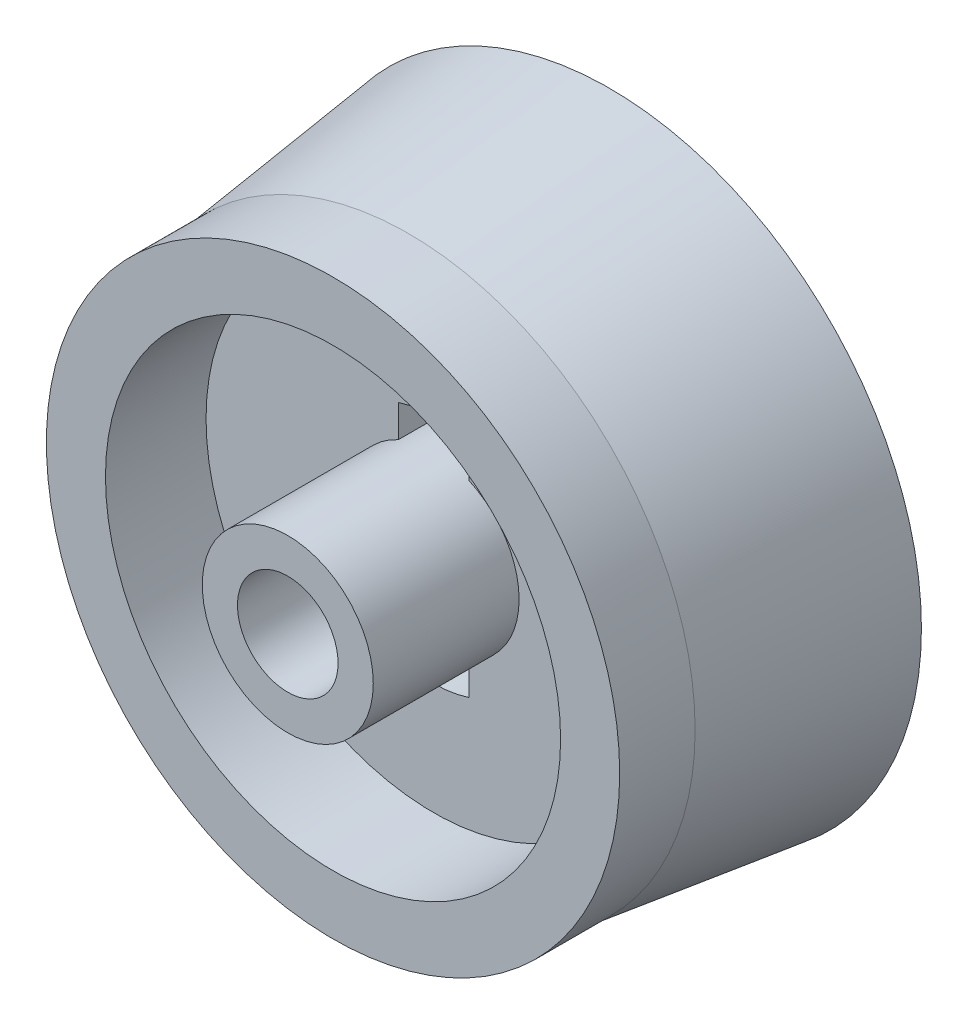
ISO-10303-21;
HEADER;
FILE_DESCRIPTION(('STEP AP214'),'2;1');
FILE_NAME('part.step','',(''),(''),'','','');
FILE_SCHEMA(('AUTOMOTIVE_DESIGN { 1 0 10303 214 1 1 1 1 }'));
ENDSEC;
DATA;
#1=APPLICATION_CONTEXT('core data for automotive mechanical design processes');
#2=APPLICATION_PROTOCOL_DEFINITION('international standard','automotive_design',2000,#1);
#3=PRODUCT_CONTEXT('',#1,'mechanical');
#4=PRODUCT('Part','Part','',(#3));
#5=PRODUCT_RELATED_PRODUCT_CATEGORY('part','',(#4));
#6=PRODUCT_DEFINITION_FORMATION('','',#4);
#7=PRODUCT_DEFINITION_CONTEXT('part definition',#1,'design');
#8=PRODUCT_DEFINITION('design','',#6,#7);
#9=PRODUCT_DEFINITION_SHAPE('','',#8);
#10=(LENGTH_UNIT() NAMED_UNIT(*) SI_UNIT(.MILLI.,.METRE.));
#11=(NAMED_UNIT(*) PLANE_ANGLE_UNIT() SI_UNIT($,.RADIAN.));
#12=(NAMED_UNIT(*) SI_UNIT($,.STERADIAN.) SOLID_ANGLE_UNIT());
#13=UNCERTAINTY_MEASURE_WITH_UNIT(LENGTH_MEASURE(1.E-05),#10,'distance_accuracy_value','');
#14=(GEOMETRIC_REPRESENTATION_CONTEXT(3) GLOBAL_UNCERTAINTY_ASSIGNED_CONTEXT((#13)) GLOBAL_UNIT_ASSIGNED_CONTEXT((#10,
#11,#12)) REPRESENTATION_CONTEXT('',''));
#15=CARTESIAN_POINT('',(0.,0.,0.));
#16=DIRECTION('',(0.,0.,1.));
#17=DIRECTION('',(1.,0.,0.));
#18=AXIS2_PLACEMENT_3D('',#15,#16,#17);
#19=CARTESIAN_POINT('',(0.,0.,1000.));
#20=DIRECTION('',(0.,0.,1.));
#21=DIRECTION('',(1.,0.,0.));
#22=AXIS2_PLACEMENT_3D('',#19,#20,#21);
#23=CYLINDRICAL_SURFACE('',#22,4.9);
#24=CARTESIAN_POINT('',(0.,0.,-3.20000000000009));
#25=DIRECTION('',(0.,0.,-1.));
#26=DIRECTION('',(-1.,0.,0.));
#27=AXIS2_PLACEMENT_3D('',#24,#25,#26);
#28=CIRCLE('',#27,4.9);
#29=CARTESIAN_POINT('',(-4.9,0.,-3.20000000000009));
#30=VERTEX_POINT('',#29);
#31=EDGE_CURVE('E153',#30,#30,#28,.T.);
#32=ORIENTED_EDGE('',*,*,#31,.F.);
#33=EDGE_LOOP('',(#32));
#34=FACE_BOUND('',#33,.T.);
#35=CARTESIAN_POINT('',(0.,0.,-4.79999999999992));
#36=DIRECTION('',(0.,0.,-1.));
#37=DIRECTION('',(-1.,0.,0.));
#38=AXIS2_PLACEMENT_3D('',#35,#36,#37);
#39=CIRCLE('',#38,4.9);
#40=CARTESIAN_POINT('',(-4.9,0.,-4.79999999999992));
#41=VERTEX_POINT('',#40);
#42=EDGE_CURVE('E40',#41,#41,#39,.F.);
#43=ORIENTED_EDGE('',*,*,#42,.F.);
#44=EDGE_LOOP('',(#43));
#45=FACE_BOUND('',#44,.T.);
#46=ADVANCED_FACE('F36',(#34,#45),#23,.F.);
#47=CARTESIAN_POINT('',(0.,0.,-3.2));
#48=DIRECTION('',(0.,0.,-1.));
#49=DIRECTION('',(-1.,0.,0.));
#50=AXIS2_PLACEMENT_3D('',#47,#48,#49);
#51=PLANE('',#50);
#52=DIRECTION('',(0.,1.,0.));
#53=VECTOR('',#52,1.);
#54=CARTESIAN_POINT('',(0.7,0.,-3.2));
#55=LINE('',#54,#53);
#56=CARTESIAN_POINT('',(0.7,-2.19089023002066,-3.2));
#57=VERTEX_POINT('',#56);
#58=CARTESIAN_POINT('',(0.7,-1.54919333848297,-3.2));
#59=VERTEX_POINT('',#58);
#60=EDGE_CURVE('E122',#57,#59,#55,.T.);
#61=ORIENTED_EDGE('',*,*,#60,.T.);
#62=CARTESIAN_POINT('',(0.,0.,-3.2));
#63=DIRECTION('',(0.,0.,-1.));
#64=DIRECTION('',(-1.,0.,0.));
#65=AXIS2_PLACEMENT_3D('',#62,#63,#64);
#66=CIRCLE('',#65,1.7);
#67=CARTESIAN_POINT('',(-0.7,-1.54919333848297,-3.2));
#68=VERTEX_POINT('',#67);
#69=EDGE_CURVE('E158',#59,#68,#66,.T.);
#70=ORIENTED_EDGE('',*,*,#69,.T.);
#71=DIRECTION('',(0.,1.,0.));
#72=VECTOR('',#71,1.);
#73=CARTESIAN_POINT('',(-0.7,0.,-3.2));
#74=LINE('',#73,#72);
#75=CARTESIAN_POINT('',(-0.7,-2.19089023002066,-3.2));
#76=VERTEX_POINT('',#75);
#77=EDGE_CURVE('E108',#76,#68,#74,.T.);
#78=ORIENTED_EDGE('',*,*,#77,.F.);
#79=CARTESIAN_POINT('',(0.,0.,-3.2));
#80=DIRECTION('',(0.,0.,-1.));
#81=DIRECTION('',(-1.,0.,0.));
#82=AXIS2_PLACEMENT_3D('',#79,#80,#81);
#83=CIRCLE('',#82,2.3);
#84=EDGE_CURVE('E165',#57,#76,#83,.T.);
#85=ORIENTED_EDGE('',*,*,#84,.F.);
#86=EDGE_LOOP('',(#61,#70,#78,#85));
#87=FACE_BOUND('',#86,.T.);
#88=CARTESIAN_POINT('',(0.,0.,-3.2));
#89=DIRECTION('',(0.,0.,-1.));
#90=DIRECTION('',(-1.,0.,0.));
#91=AXIS2_PLACEMENT_3D('',#88,#89,#90);
#92=CIRCLE('',#91,2.3);
#93=CARTESIAN_POINT('',(-0.7,2.19089023002066,-3.2));
#94=VERTEX_POINT('',#93);
#95=CARTESIAN_POINT('',(0.7,2.19089023002066,-3.2));
#96=VERTEX_POINT('',#95);
#97=EDGE_CURVE('E171',#94,#96,#92,.T.);
#98=ORIENTED_EDGE('',*,*,#97,.F.);
#99=DIRECTION('',(0.,1.,0.));
#100=VECTOR('',#99,1.);
#101=CARTESIAN_POINT('',(-0.7,0.,-3.2));
#102=LINE('',#101,#100);
#103=CARTESIAN_POINT('',(-0.7,1.54919333848297,-3.2));
#104=VERTEX_POINT('',#103);
#105=EDGE_CURVE('E169',#104,#94,#102,.T.);
#106=ORIENTED_EDGE('',*,*,#105,.F.);
#107=CARTESIAN_POINT('',(0.,0.,-3.2));
#108=DIRECTION('',(0.,0.,-1.));
#109=DIRECTION('',(-1.,0.,0.));
#110=AXIS2_PLACEMENT_3D('',#107,#108,#109);
#111=CIRCLE('',#110,1.7);
#112=CARTESIAN_POINT('',(0.7,1.54919333848297,-3.2));
#113=VERTEX_POINT('',#112);
#114=EDGE_CURVE('E177',#104,#113,#111,.T.);
#115=ORIENTED_EDGE('',*,*,#114,.T.);
#116=DIRECTION('',(0.,1.,0.));
#117=VECTOR('',#116,1.);
#118=CARTESIAN_POINT('',(0.7,0.,-3.2));
#119=LINE('',#118,#117);
#120=EDGE_CURVE('E174',#113,#96,#119,.T.);
#121=ORIENTED_EDGE('',*,*,#120,.T.);
#122=EDGE_LOOP('',(#98,#106,#115,#121));
#123=FACE_BOUND('',#122,.T.);
#124=CARTESIAN_POINT('',(0.,0.,-3.2));
#125=DIRECTION('',(0.,0.,-1.));
#126=DIRECTION('',(-1.,0.,0.));
#127=AXIS2_PLACEMENT_3D('',#124,#125,#126);
#128=CIRCLE('',#127,1.15);
#129=CARTESIAN_POINT('',(-1.15,0.,-3.2));
#130=VERTEX_POINT('',#129);
#131=EDGE_CURVE('E148',#130,#130,#128,.T.);
#132=ORIENTED_EDGE('',*,*,#131,.F.);
#133=EDGE_LOOP('',(#132));
#134=FACE_BOUND('',#133,.T.);
#135=ORIENTED_EDGE('',*,*,#31,.T.);
#136=EDGE_LOOP('',(#135));
#137=FACE_BOUND('',#136,.T.);
#138=ADVANCED_FACE('F213',(#87,#123,#134,#137),#51,.T.);
#139=CARTESIAN_POINT('',(0.,0.,-2.));
#140=DIRECTION('',(0.,0.,-1.));
#141=DIRECTION('',(-1.,0.,0.));
#142=AXIS2_PLACEMENT_3D('',#139,#140,#141);
#143=PLANE('',#142);
#144=CARTESIAN_POINT('',(0.,0.,-2.));
#145=DIRECTION('',(0.,0.,-1.));
#146=DIRECTION('',(-1.,0.,0.));
#147=AXIS2_PLACEMENT_3D('',#144,#145,#146);
#148=CIRCLE('',#147,1.7);
#149=CARTESIAN_POINT('',(0.7,-1.54919333848297,-2.));
#150=VERTEX_POINT('',#149);
#151=CARTESIAN_POINT('',(0.7,1.54919333848297,-2.));
#152=VERTEX_POINT('',#151);
#153=EDGE_CURVE('E130',#150,#152,#148,.F.);
#154=ORIENTED_EDGE('',*,*,#153,.F.);
#155=DIRECTION('',(0.,1.,0.));
#156=VECTOR('',#155,1.);
#157=CARTESIAN_POINT('',(0.7,0.,-2.));
#158=LINE('',#157,#156);
#159=CARTESIAN_POINT('',(0.7,-2.19089023002066,-2.));
#160=VERTEX_POINT('',#159);
#161=EDGE_CURVE('E52',#160,#150,#158,.T.);
#162=ORIENTED_EDGE('',*,*,#161,.F.);
#163=CARTESIAN_POINT('',(0.,0.,-2.));
#164=DIRECTION('',(0.,0.,-1.));
#165=DIRECTION('',(-1.,0.,0.));
#166=AXIS2_PLACEMENT_3D('',#163,#164,#165);
#167=CIRCLE('',#166,2.3);
#168=CARTESIAN_POINT('',(-0.7,-2.19089023002066,-2.));
#169=VERTEX_POINT('',#168);
#170=EDGE_CURVE('E121',#160,#169,#167,.T.);
#171=ORIENTED_EDGE('',*,*,#170,.T.);
#172=DIRECTION('',(0.,1.,0.));
#173=VECTOR('',#172,1.);
#174=CARTESIAN_POINT('',(-0.7,0.,-2.));
#175=LINE('',#174,#173);
#176=CARTESIAN_POINT('',(-0.7,-1.54919333848297,-2.));
#177=VERTEX_POINT('',#176);
#178=EDGE_CURVE('E105',#169,#177,#175,.T.);
#179=ORIENTED_EDGE('',*,*,#178,.T.);
#180=CARTESIAN_POINT('',(-0.7,1.54919333848297,-2.));
#181=VERTEX_POINT('',#180);
#182=EDGE_CURVE('E119',#181,#177,#148,.F.);
#183=ORIENTED_EDGE('',*,*,#182,.F.);
#184=DIRECTION('',(0.,1.,0.));
#185=VECTOR('',#184,1.);
#186=CARTESIAN_POINT('',(-0.7,0.,-2.));
#187=LINE('',#186,#185);
#188=CARTESIAN_POINT('',(-0.7,2.19089023002066,-2.));
#189=VERTEX_POINT('',#188);
#190=EDGE_CURVE('E162',#181,#189,#187,.T.);
#191=ORIENTED_EDGE('',*,*,#190,.T.);
#192=CARTESIAN_POINT('',(0.,0.,-2.));
#193=DIRECTION('',(0.,0.,-1.));
#194=DIRECTION('',(-1.,0.,0.));
#195=AXIS2_PLACEMENT_3D('',#192,#193,#194);
#196=CIRCLE('',#195,2.3);
#197=CARTESIAN_POINT('',(0.7,2.19089023002066,-2.));
#198=VERTEX_POINT('',#197);
#199=EDGE_CURVE('E181',#189,#198,#196,.T.);
#200=ORIENTED_EDGE('',*,*,#199,.T.);
#201=DIRECTION('',(0.,1.,0.));
#202=VECTOR('',#201,1.);
#203=CARTESIAN_POINT('',(0.7,0.,-2.));
#204=LINE('',#203,#202);
#205=EDGE_CURVE('E172',#152,#198,#204,.T.);
#206=ORIENTED_EDGE('',*,*,#205,.F.);
#207=EDGE_LOOP('',(#154,#162,#171,#179,#183,#191,#200,#206));
#208=FACE_BOUND('',#207,.T.);
#209=CARTESIAN_POINT('',(0.,0.,-2.));
#210=DIRECTION('',(0.,0.,-1.));
#211=DIRECTION('',(-1.,0.,0.));
#212=AXIS2_PLACEMENT_3D('',#209,#210,#211);
#213=CIRCLE('',#212,4.525);
#214=CARTESIAN_POINT('',(-4.525,0.,-2.));
#215=VERTEX_POINT('',#214);
#216=EDGE_CURVE('E12',#215,#215,#213,.T.);
#217=ORIENTED_EDGE('',*,*,#216,.F.);
#218=EDGE_LOOP('',(#217));
#219=FACE_BOUND('',#218,.T.);
#220=ADVANCED_FACE('F116',(#208,#219),#143,.F.);
#221=CARTESIAN_POINT('',(0.,0.,-2.));
#222=DIRECTION('',(0.,0.,1.));
#223=DIRECTION('',(1.,0.,0.));
#224=AXIS2_PLACEMENT_3D('',#221,#222,#223);
#225=CYLINDRICAL_SURFACE('',#224,1.);
#226=CARTESIAN_POINT('',(0.,0.,-2.3));
#227=DIRECTION('',(0.,0.,1.));
#228=DIRECTION('',(1.,0.,0.));
#229=AXIS2_PLACEMENT_3D('',#226,#227,#228);
#230=CIRCLE('',#229,1.);
#231=CARTESIAN_POINT('',(1.,0.,-2.3));
#232=VERTEX_POINT('',#231);
#233=EDGE_CURVE('E140',#232,#232,#230,.F.);
#234=ORIENTED_EDGE('',*,*,#233,.T.);
#235=EDGE_LOOP('',(#234));
#236=FACE_BOUND('',#235,.T.);
#237=CARTESIAN_POINT('',(0.,0.,0.9));
#238=DIRECTION('',(0.,0.,1.));
#239=DIRECTION('',(1.,0.,0.));
#240=AXIS2_PLACEMENT_3D('',#237,#238,#239);
#241=CIRCLE('',#240,1.);
#242=CARTESIAN_POINT('',(1.,0.,0.9));
#243=VERTEX_POINT('',#242);
#244=EDGE_CURVE('E129',#243,#243,#241,.T.);
#245=ORIENTED_EDGE('',*,*,#244,.T.);
#246=EDGE_LOOP('',(#245));
#247=FACE_BOUND('',#246,.T.);
#248=ADVANCED_FACE('F38',(#236,#247),#225,.F.);
#249=CARTESIAN_POINT('',(0.,0.,-2.));
#250=DIRECTION('',(0.,0.,1.));
#251=DIRECTION('',(1.,0.,0.));
#252=AXIS2_PLACEMENT_3D('',#249,#250,#251);
#253=CYLINDRICAL_SURFACE('',#252,1.7);
#254=ORIENTED_EDGE('',*,*,#182,.T.);
#255=DIRECTION('',(0.,0.,1.));
#256=VECTOR('',#255,1.);
#257=CARTESIAN_POINT('',(-0.7,-1.54919333848297,-3.2));
#258=LINE('',#257,#256);
#259=EDGE_CURVE('E60',#68,#177,#258,.T.);
#260=ORIENTED_EDGE('',*,*,#259,.F.);
#261=ORIENTED_EDGE('',*,*,#69,.F.);
#262=DIRECTION('',(0.,0.,1.));
#263=VECTOR('',#262,1.);
#264=CARTESIAN_POINT('',(0.7,-1.54919333848297,-3.2));
#265=LINE('',#264,#263);
#266=EDGE_CURVE('E110',#59,#150,#265,.T.);
#267=ORIENTED_EDGE('',*,*,#266,.T.);
#268=ORIENTED_EDGE('',*,*,#153,.T.);
#269=DIRECTION('',(0.,0.,1.));
#270=VECTOR('',#269,1.);
#271=CARTESIAN_POINT('',(0.7,1.54919333848297,-3.2));
#272=LINE('',#271,#270);
#273=EDGE_CURVE('E187',#113,#152,#272,.T.);
#274=ORIENTED_EDGE('',*,*,#273,.F.);
#275=ORIENTED_EDGE('',*,*,#114,.F.);
#276=DIRECTION('',(0.,0.,1.));
#277=VECTOR('',#276,1.);
#278=CARTESIAN_POINT('',(-0.7,1.54919333848297,-3.2));
#279=LINE('',#278,#277);
#280=EDGE_CURVE('E128',#104,#181,#279,.T.);
#281=ORIENTED_EDGE('',*,*,#280,.T.);
#282=EDGE_LOOP('',(#254,#260,#261,#267,#268,#274,#275,#281));
#283=FACE_BOUND('',#282,.T.);
#284=CARTESIAN_POINT('',(0.,0.,0.9));
#285=DIRECTION('',(0.,0.,1.));
#286=DIRECTION('',(1.,0.,0.));
#287=AXIS2_PLACEMENT_3D('',#284,#285,#286);
#288=CIRCLE('',#287,1.7);
#289=CARTESIAN_POINT('',(1.7,0.,0.9));
#290=VERTEX_POINT('',#289);
#291=EDGE_CURVE('E45',#290,#290,#288,.T.);
#292=ORIENTED_EDGE('',*,*,#291,.F.);
#293=EDGE_LOOP('',(#292));
#294=FACE_BOUND('',#293,.T.);
#295=ADVANCED_FACE('F125',(#283,#294),#253,.T.);
#296=CARTESIAN_POINT('',(0.,0.,0.9));
#297=DIRECTION('',(0.,0.,1.));
#298=DIRECTION('',(1.,0.,0.));
#299=AXIS2_PLACEMENT_3D('',#296,#297,#298);
#300=PLANE('',#299);
#301=ORIENTED_EDGE('',*,*,#244,.F.);
#302=EDGE_LOOP('',(#301));
#303=FACE_BOUND('',#302,.T.);
#304=ORIENTED_EDGE('',*,*,#291,.T.);
#305=EDGE_LOOP('',(#304));
#306=FACE_BOUND('',#305,.T.);
#307=ADVANCED_FACE('F210',(#303,#306),#300,.T.);
#308=CARTESIAN_POINT('',(-0.7,0.,-3.2));
#309=DIRECTION('',(1.,0.,0.));
#310=DIRECTION('',(0.,0.,-1.));
#311=AXIS2_PLACEMENT_3D('',#308,#309,#310);
#312=PLANE('',#311);
#313=ORIENTED_EDGE('',*,*,#190,.F.);
#314=ORIENTED_EDGE('',*,*,#280,.F.);
#315=ORIENTED_EDGE('',*,*,#105,.T.);
#316=DIRECTION('',(0.,0.,1.));
#317=VECTOR('',#316,1.);
#318=CARTESIAN_POINT('',(-0.7,2.19089023002066,-3.2));
#319=LINE('',#318,#317);
#320=EDGE_CURVE('E134',#94,#189,#319,.T.);
#321=ORIENTED_EDGE('',*,*,#320,.T.);
#322=EDGE_LOOP('',(#313,#314,#315,#321));
#323=FACE_BOUND('',#322,.T.);
#324=ADVANCED_FACE('F195',(#323),#312,.T.);
#325=CARTESIAN_POINT('',(0.,0.,-3.2));
#326=DIRECTION('',(0.,0.,1.));
#327=DIRECTION('',(1.,0.,0.));
#328=AXIS2_PLACEMENT_3D('',#325,#326,#327);
#329=CYLINDRICAL_SURFACE('',#328,2.3);
#330=ORIENTED_EDGE('',*,*,#199,.F.);
#331=ORIENTED_EDGE('',*,*,#320,.F.);
#332=ORIENTED_EDGE('',*,*,#97,.T.);
#333=DIRECTION('',(0.,0.,1.));
#334=VECTOR('',#333,1.);
#335=CARTESIAN_POINT('',(0.7,2.19089023002066,-3.2));
#336=LINE('',#335,#334);
#337=EDGE_CURVE('E189',#96,#198,#336,.T.);
#338=ORIENTED_EDGE('',*,*,#337,.T.);
#339=EDGE_LOOP('',(#330,#331,#332,#338));
#340=FACE_BOUND('',#339,.T.);
#341=ADVANCED_FACE('F199',(#340),#329,.F.);
#342=CARTESIAN_POINT('',(0.7,0.,-3.2));
#343=DIRECTION('',(1.,0.,0.));
#344=DIRECTION('',(0.,0.,-1.));
#345=AXIS2_PLACEMENT_3D('',#342,#343,#344);
#346=PLANE('',#345);
#347=ORIENTED_EDGE('',*,*,#205,.T.);
#348=ORIENTED_EDGE('',*,*,#337,.F.);
#349=ORIENTED_EDGE('',*,*,#120,.F.);
#350=ORIENTED_EDGE('',*,*,#273,.T.);
#351=EDGE_LOOP('',(#347,#348,#349,#350));
#352=FACE_BOUND('',#351,.T.);
#353=ADVANCED_FACE('F201',(#352),#346,.F.);
#354=CARTESIAN_POINT('',(0.7,0.,-3.2));
#355=DIRECTION('',(1.,0.,0.));
#356=DIRECTION('',(0.,0.,-1.));
#357=AXIS2_PLACEMENT_3D('',#354,#355,#356);
#358=PLANE('',#357);
#359=ORIENTED_EDGE('',*,*,#161,.T.);
#360=ORIENTED_EDGE('',*,*,#266,.F.);
#361=ORIENTED_EDGE('',*,*,#60,.F.);
#362=DIRECTION('',(0.,0.,1.));
#363=VECTOR('',#362,1.);
#364=CARTESIAN_POINT('',(0.7,-2.19089023002066,-3.2));
#365=LINE('',#364,#363);
#366=EDGE_CURVE('E142',#57,#160,#365,.T.);
#367=ORIENTED_EDGE('',*,*,#366,.T.);
#368=EDGE_LOOP('',(#359,#360,#361,#367));
#369=FACE_BOUND('',#368,.T.);
#370=ADVANCED_FACE('F207',(#369),#358,.F.);
#371=CARTESIAN_POINT('',(0.,0.,-3.2));
#372=DIRECTION('',(0.,0.,1.));
#373=DIRECTION('',(1.,0.,0.));
#374=AXIS2_PLACEMENT_3D('',#371,#372,#373);
#375=CYLINDRICAL_SURFACE('',#374,2.3);
#376=ORIENTED_EDGE('',*,*,#170,.F.);
#377=ORIENTED_EDGE('',*,*,#366,.F.);
#378=ORIENTED_EDGE('',*,*,#84,.T.);
#379=DIRECTION('',(0.,0.,1.));
#380=VECTOR('',#379,1.);
#381=CARTESIAN_POINT('',(-0.7,-2.19089023002066,-3.2));
#382=LINE('',#381,#380);
#383=EDGE_CURVE('E111',#76,#169,#382,.T.);
#384=ORIENTED_EDGE('',*,*,#383,.T.);
#385=EDGE_LOOP('',(#376,#377,#378,#384));
#386=FACE_BOUND('',#385,.T.);
#387=ADVANCED_FACE('F244',(#386),#375,.F.);
#388=CARTESIAN_POINT('',(-0.7,0.,-3.2));
#389=DIRECTION('',(1.,0.,0.));
#390=DIRECTION('',(0.,0.,-1.));
#391=AXIS2_PLACEMENT_3D('',#388,#389,#390);
#392=PLANE('',#391);
#393=ORIENTED_EDGE('',*,*,#178,.F.);
#394=ORIENTED_EDGE('',*,*,#383,.F.);
#395=ORIENTED_EDGE('',*,*,#77,.T.);
#396=ORIENTED_EDGE('',*,*,#259,.T.);
#397=EDGE_LOOP('',(#393,#394,#395,#396));
#398=FACE_BOUND('',#397,.T.);
#399=ADVANCED_FACE('F103',(#398),#392,.T.);
#400=CARTESIAN_POINT('',(0.,0.,-2.3));
#401=DIRECTION('',(0.,0.,1.));
#402=DIRECTION('',(1.,0.,0.));
#403=AXIS2_PLACEMENT_3D('',#400,#401,#402);
#404=PLANE('',#403);
#405=CARTESIAN_POINT('',(0.,0.,-2.3));
#406=DIRECTION('',(0.,0.,1.));
#407=DIRECTION('',(1.,0.,0.));
#408=AXIS2_PLACEMENT_3D('',#405,#406,#407);
#409=CIRCLE('',#408,1.15);
#410=CARTESIAN_POINT('',(1.15,0.,-2.3));
#411=VERTEX_POINT('',#410);
#412=EDGE_CURVE('E143',#411,#411,#409,.F.);
#413=ORIENTED_EDGE('',*,*,#412,.T.);
#414=EDGE_LOOP('',(#413));
#415=FACE_BOUND('',#414,.T.);
#416=ORIENTED_EDGE('',*,*,#233,.F.);
#417=EDGE_LOOP('',(#416));
#418=FACE_BOUND('',#417,.T.);
#419=ADVANCED_FACE('F238',(#415,#418),#404,.F.);
#420=CARTESIAN_POINT('',(0.,0.,4.15269119345812));
#421=DIRECTION('',(0.,0.,-1.));
#422=DIRECTION('',(-1.,0.,0.));
#423=AXIS2_PLACEMENT_3D('',#420,#421,#422);
#424=CYLINDRICAL_SURFACE('',#423,1.15);
#425=ORIENTED_EDGE('',*,*,#131,.T.);
#426=EDGE_LOOP('',(#425));
#427=FACE_BOUND('',#426,.T.);
#428=ORIENTED_EDGE('',*,*,#412,.F.);
#429=EDGE_LOOP('',(#428));
#430=FACE_BOUND('',#429,.T.);
#431=ADVANCED_FACE('F234',(#427,#430),#424,.F.);
#432=CARTESIAN_POINT('',(0.,0.,-1.50000000000006));
#433=DIRECTION('',(0.,0.,-1.));
#434=DIRECTION('',(-1.,0.,0.));
#435=AXIS2_PLACEMENT_3D('',#432,#433,#434);
#436=CONICAL_SURFACE('',#435,5.7,0.124354994546761);
#437=CARTESIAN_POINT('',(0.,0.,-5.50000000000006));
#438=DIRECTION('',(0.,0.,1.));
#439=DIRECTION('',(1.,0.,0.));
#440=AXIS2_PLACEMENT_3D('',#437,#438,#439);
#441=CIRCLE('',#440,6.2);
#442=CARTESIAN_POINT('',(6.2,0.,-5.50000000000006));
#443=VERTEX_POINT('',#442);
#444=EDGE_CURVE('E436',#443,#443,#441,.T.);
#445=ORIENTED_EDGE('',*,*,#444,.T.);
#446=EDGE_LOOP('',(#445));
#447=FACE_BOUND('',#446,.T.);
#448=CARTESIAN_POINT('',(0.,0.,-1.50000000000006));
#449=DIRECTION('',(0.,0.,1.));
#450=DIRECTION('',(1.,0.,0.));
#451=AXIS2_PLACEMENT_3D('',#448,#449,#450);
#452=CIRCLE('',#451,5.7);
#453=CARTESIAN_POINT('',(5.7,0.,-1.50000000000006));
#454=VERTEX_POINT('',#453);
#455=EDGE_CURVE('E439',#454,#454,#452,.T.);
#456=ORIENTED_EDGE('',*,*,#455,.F.);
#457=EDGE_LOOP('',(#456));
#458=FACE_BOUND('',#457,.T.);
#459=ADVANCED_FACE('F230',(#447,#458),#436,.T.);
#460=CARTESIAN_POINT('',(0.,0.,1000.));
#461=DIRECTION('',(0.,0.,1.));
#462=DIRECTION('',(1.,0.,0.));
#463=AXIS2_PLACEMENT_3D('',#460,#461,#462);
#464=CYLINDRICAL_SURFACE('',#463,4.525);
#465=ORIENTED_EDGE('',*,*,#216,.T.);
#466=EDGE_LOOP('',(#465));
#467=FACE_BOUND('',#466,.T.);
#468=CARTESIAN_POINT('',(0.,0.,0.));
#469=DIRECTION('',(0.,0.,1.));
#470=DIRECTION('',(1.,0.,0.));
#471=AXIS2_PLACEMENT_3D('',#468,#469,#470);
#472=CIRCLE('',#471,4.525);
#473=CARTESIAN_POINT('',(4.525,0.,0.));
#474=VERTEX_POINT('',#473);
#475=EDGE_CURVE('E430',#474,#474,#472,.T.);
#476=ORIENTED_EDGE('',*,*,#475,.T.);
#477=EDGE_LOOP('',(#476));
#478=FACE_BOUND('',#477,.T.);
#479=ADVANCED_FACE('F227',(#467,#478),#464,.F.);
#480=CARTESIAN_POINT('',(0.,0.,-5.5));
#481=DIRECTION('',(0.,0.,1.));
#482=DIRECTION('',(1.,0.,0.));
#483=AXIS2_PLACEMENT_3D('',#480,#481,#482);
#484=PLANE('',#483);
#485=CARTESIAN_POINT('',(0.,0.,-5.5));
#486=DIRECTION('',(0.,0.,-1.));
#487=DIRECTION('',(-1.,0.,0.));
#488=AXIS2_PLACEMENT_3D('',#485,#486,#487);
#489=CIRCLE('',#488,5.325);
#490=CARTESIAN_POINT('',(-5.325,0.,-5.5));
#491=VERTEX_POINT('',#490);
#492=EDGE_CURVE('E426',#491,#491,#489,.T.);
#493=ORIENTED_EDGE('',*,*,#492,.F.);
#494=EDGE_LOOP('',(#493));
#495=FACE_BOUND('',#494,.T.);
#496=ORIENTED_EDGE('',*,*,#444,.F.);
#497=EDGE_LOOP('',(#496));
#498=FACE_BOUND('',#497,.T.);
#499=ADVANCED_FACE('F225',(#495,#498),#484,.F.);
#500=CARTESIAN_POINT('',(0.,0.,-1.5));
#501=DIRECTION('',(0.,0.,1.));
#502=DIRECTION('',(1.,0.,0.));
#503=AXIS2_PLACEMENT_3D('',#500,#501,#502);
#504=CYLINDRICAL_SURFACE('',#503,5.7);
#505=ORIENTED_EDGE('',*,*,#455,.T.);
#506=EDGE_LOOP('',(#505));
#507=FACE_BOUND('',#506,.T.);
#508=CARTESIAN_POINT('',(0.,0.,0.));
#509=DIRECTION('',(0.,0.,1.));
#510=DIRECTION('',(1.,0.,0.));
#511=AXIS2_PLACEMENT_3D('',#508,#509,#510);
#512=CIRCLE('',#511,5.7);
#513=CARTESIAN_POINT('',(5.7,0.,0.));
#514=VERTEX_POINT('',#513);
#515=EDGE_CURVE('E433',#514,#514,#512,.T.);
#516=ORIENTED_EDGE('',*,*,#515,.F.);
#517=EDGE_LOOP('',(#516));
#518=FACE_BOUND('',#517,.T.);
#519=ADVANCED_FACE('F279',(#507,#518),#504,.T.);
#520=CARTESIAN_POINT('',(0.,0.,0.));
#521=DIRECTION('',(0.,0.,1.));
#522=DIRECTION('',(1.,0.,0.));
#523=AXIS2_PLACEMENT_3D('',#520,#521,#522);
#524=PLANE('',#523);
#525=ORIENTED_EDGE('',*,*,#475,.F.);
#526=EDGE_LOOP('',(#525));
#527=FACE_BOUND('',#526,.T.);
#528=ORIENTED_EDGE('',*,*,#515,.T.);
#529=EDGE_LOOP('',(#528));
#530=FACE_BOUND('',#529,.T.);
#531=ADVANCED_FACE('F286',(#527,#530),#524,.T.);
#532=CARTESIAN_POINT('',(0.,0.,-4.8));
#533=DIRECTION('',(0.,0.,-1.));
#534=DIRECTION('',(-1.,0.,0.));
#535=AXIS2_PLACEMENT_3D('',#532,#533,#534);
#536=PLANE('',#535);
#537=CARTESIAN_POINT('',(0.,0.,-4.8));
#538=DIRECTION('',(0.,0.,-1.));
#539=DIRECTION('',(-1.,0.,0.));
#540=AXIS2_PLACEMENT_3D('',#537,#538,#539);
#541=CIRCLE('',#540,5.325);
#542=CARTESIAN_POINT('',(-5.325,0.,-4.8));
#543=VERTEX_POINT('',#542);
#544=EDGE_CURVE('E423',#543,#543,#541,.T.);
#545=ORIENTED_EDGE('',*,*,#544,.T.);
#546=EDGE_LOOP('',(#545));
#547=FACE_BOUND('',#546,.T.);
#548=ORIENTED_EDGE('',*,*,#42,.T.);
#549=EDGE_LOOP('',(#548));
#550=FACE_BOUND('',#549,.T.);
#551=ADVANCED_FACE('F293',(#547,#550),#536,.T.);
#552=CARTESIAN_POINT('',(0.,0.,-4.8));
#553=DIRECTION('',(0.,0.,-1.));
#554=DIRECTION('',(-1.,0.,0.));
#555=AXIS2_PLACEMENT_3D('',#552,#553,#554);
#556=CYLINDRICAL_SURFACE('',#555,5.325);
#557=ORIENTED_EDGE('',*,*,#544,.F.);
#558=EDGE_LOOP('',(#557));
#559=FACE_BOUND('',#558,.T.);
#560=ORIENTED_EDGE('',*,*,#492,.T.);
#561=EDGE_LOOP('',(#560));
#562=FACE_BOUND('',#561,.T.);
#563=ADVANCED_FACE('F300',(#559,#562),#556,.F.);
#564=CLOSED_SHELL('',(#46,#138,#220,#248,#295,#307,#324,#341,#353,#370,#387,#399,#419,#431,#459,
#479,#499,#519,#531,#551,#563));
#565=MANIFOLD_SOLID_BREP('B2',#564);
#566=ADVANCED_BREP_SHAPE_REPRESENTATION('',(#18,#565),#14);
#567=SHAPE_DEFINITION_REPRESENTATION(#9,#566);
ENDSEC;
END-ISO-10303-21;
